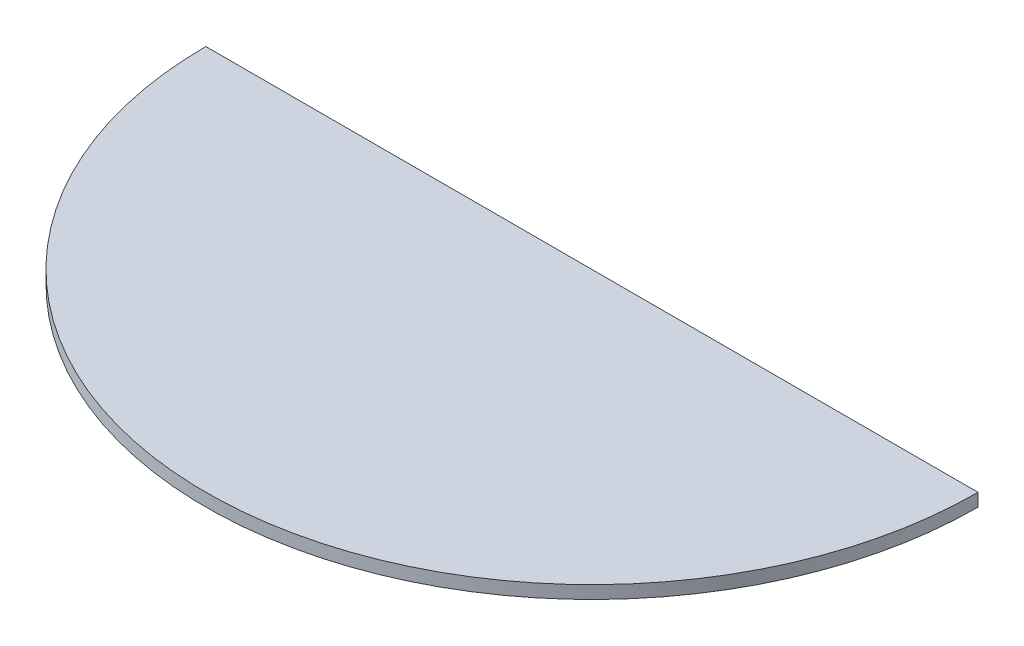
ISO-10303-21;
HEADER;
FILE_DESCRIPTION(('STEP AP214'),'2;1');
FILE_NAME('part.step','',(''),(''),'','','');
FILE_SCHEMA(('AUTOMOTIVE_DESIGN { 1 0 10303 214 1 1 1 1 }'));
ENDSEC;
DATA;
#1=APPLICATION_CONTEXT('core data for automotive mechanical design processes');
#2=APPLICATION_PROTOCOL_DEFINITION('international standard','automotive_design',2000,#1);
#3=PRODUCT_CONTEXT('',#1,'mechanical');
#4=PRODUCT('Part','Part','',(#3));
#5=PRODUCT_RELATED_PRODUCT_CATEGORY('part','',(#4));
#6=PRODUCT_DEFINITION_FORMATION('','',#4);
#7=PRODUCT_DEFINITION_CONTEXT('part definition',#1,'design');
#8=PRODUCT_DEFINITION('design','',#6,#7);
#9=PRODUCT_DEFINITION_SHAPE('','',#8);
#10=(LENGTH_UNIT() NAMED_UNIT(*) SI_UNIT(.MILLI.,.METRE.));
#11=(NAMED_UNIT(*) PLANE_ANGLE_UNIT() SI_UNIT($,.RADIAN.));
#12=(NAMED_UNIT(*) SI_UNIT($,.STERADIAN.) SOLID_ANGLE_UNIT());
#13=UNCERTAINTY_MEASURE_WITH_UNIT(LENGTH_MEASURE(1.E-05),#10,'distance_accuracy_value','');
#14=(GEOMETRIC_REPRESENTATION_CONTEXT(3) GLOBAL_UNCERTAINTY_ASSIGNED_CONTEXT((#13)) GLOBAL_UNIT_ASSIGNED_CONTEXT((#10,
#11,#12)) REPRESENTATION_CONTEXT('',''));
#15=CARTESIAN_POINT('',(0.,0.,0.));
#16=DIRECTION('',(0.,0.,1.));
#17=DIRECTION('',(1.,0.,0.));
#18=AXIS2_PLACEMENT_3D('',#15,#16,#17);
#19=CARTESIAN_POINT('',(-221.91723528402,10.,0.));
#20=DIRECTION('',(0.,0.,-1.));
#21=DIRECTION('',(-1.,0.,0.));
#22=AXIS2_PLACEMENT_3D('',#19,#20,#21);
#23=PLANE('',#22);
#24=DIRECTION('',(1.,0.,0.));
#25=VECTOR('',#24,1.);
#26=CARTESIAN_POINT('',(-221.91723528402,0.,0.));
#27=LINE('',#26,#25);
#28=CARTESIAN_POINT('',(0.,0.,0.));
#29=VERTEX_POINT('',#28);
#30=CARTESIAN_POINT('',(600.,0.,0.));
#31=VERTEX_POINT('',#30);
#32=EDGE_CURVE('E59',#29,#31,#27,.T.);
#33=ORIENTED_EDGE('',*,*,#32,.F.);
#34=DIRECTION('',(0.,-1.,0.));
#35=VECTOR('',#34,1.);
#36=CARTESIAN_POINT('',(0.,10.,0.));
#37=LINE('',#36,#35);
#38=CARTESIAN_POINT('',(0.,10.,0.));
#39=VERTEX_POINT('',#38);
#40=EDGE_CURVE('E11',#39,#29,#37,.T.);
#41=ORIENTED_EDGE('',*,*,#40,.F.);
#42=DIRECTION('',(1.,0.,0.));
#43=VECTOR('',#42,1.);
#44=CARTESIAN_POINT('',(-221.91723528402,10.,0.));
#45=LINE('',#44,#43);
#46=CARTESIAN_POINT('',(600.,10.,0.));
#47=VERTEX_POINT('',#46);
#48=EDGE_CURVE('E60',#39,#47,#45,.T.);
#49=ORIENTED_EDGE('',*,*,#48,.T.);
#50=DIRECTION('',(0.,-1.,0.));
#51=VECTOR('',#50,1.);
#52=CARTESIAN_POINT('',(600.,10.,0.));
#53=LINE('',#52,#51);
#54=EDGE_CURVE('E39',#47,#31,#53,.T.);
#55=ORIENTED_EDGE('',*,*,#54,.T.);
#56=EDGE_LOOP('',(#33,#41,#49,#55));
#57=FACE_BOUND('',#56,.T.);
#58=ADVANCED_FACE('F31',(#57),#23,.T.);
#59=CARTESIAN_POINT('',(300.,10.,0.));
#60=DIRECTION('',(0.,-1.,0.));
#61=DIRECTION('',(0.,0.,-1.));
#62=AXIS2_PLACEMENT_3D('',#59,#60,#61);
#63=CYLINDRICAL_SURFACE('',#62,300.);
#64=CARTESIAN_POINT('',(300.,0.,0.));
#65=DIRECTION('',(0.,1.,0.));
#66=DIRECTION('',(0.,0.,1.));
#67=AXIS2_PLACEMENT_3D('',#64,#65,#66);
#68=CIRCLE('',#67,300.);
#69=EDGE_CURVE('E61',#29,#31,#68,.T.);
#70=ORIENTED_EDGE('',*,*,#69,.T.);
#71=ORIENTED_EDGE('',*,*,#54,.F.);
#72=CARTESIAN_POINT('',(300.,10.,0.));
#73=DIRECTION('',(0.,1.,0.));
#74=DIRECTION('',(0.,0.,1.));
#75=AXIS2_PLACEMENT_3D('',#72,#73,#74);
#76=CIRCLE('',#75,300.);
#77=EDGE_CURVE('E46',#39,#47,#76,.T.);
#78=ORIENTED_EDGE('',*,*,#77,.F.);
#79=ORIENTED_EDGE('',*,*,#40,.T.);
#80=EDGE_LOOP('',(#70,#71,#78,#79));
#81=FACE_BOUND('',#80,.T.);
#82=ADVANCED_FACE('F62',(#81),#63,.T.);
#83=CARTESIAN_POINT('',(-221.91723528402,10.,150.));
#84=DIRECTION('',(0.,1.,0.));
#85=DIRECTION('',(0.,0.,1.));
#86=AXIS2_PLACEMENT_3D('',#83,#84,#85);
#87=PLANE('',#86);
#88=ORIENTED_EDGE('',*,*,#48,.F.);
#89=ORIENTED_EDGE('',*,*,#77,.T.);
#90=EDGE_LOOP('',(#88,#89));
#91=FACE_BOUND('',#90,.T.);
#92=ADVANCED_FACE('F70',(#91),#87,.T.);
#93=CARTESIAN_POINT('',(-221.91723528402,0.,150.));
#94=DIRECTION('',(0.,1.,0.));
#95=DIRECTION('',(0.,0.,1.));
#96=AXIS2_PLACEMENT_3D('',#93,#94,#95);
#97=PLANE('',#96);
#98=ORIENTED_EDGE('',*,*,#32,.T.);
#99=ORIENTED_EDGE('',*,*,#69,.F.);
#100=EDGE_LOOP('',(#98,#99));
#101=FACE_BOUND('',#100,.T.);
#102=ADVANCED_FACE('F65',(#101),#97,.F.);
#103=CLOSED_SHELL('',(#58,#82,#92,#102));
#104=MANIFOLD_SOLID_BREP('B2',#103);
#105=ADVANCED_BREP_SHAPE_REPRESENTATION('',(#18,#104),#14);
#106=SHAPE_DEFINITION_REPRESENTATION(#9,#105);
ENDSEC;
END-ISO-10303-21;
